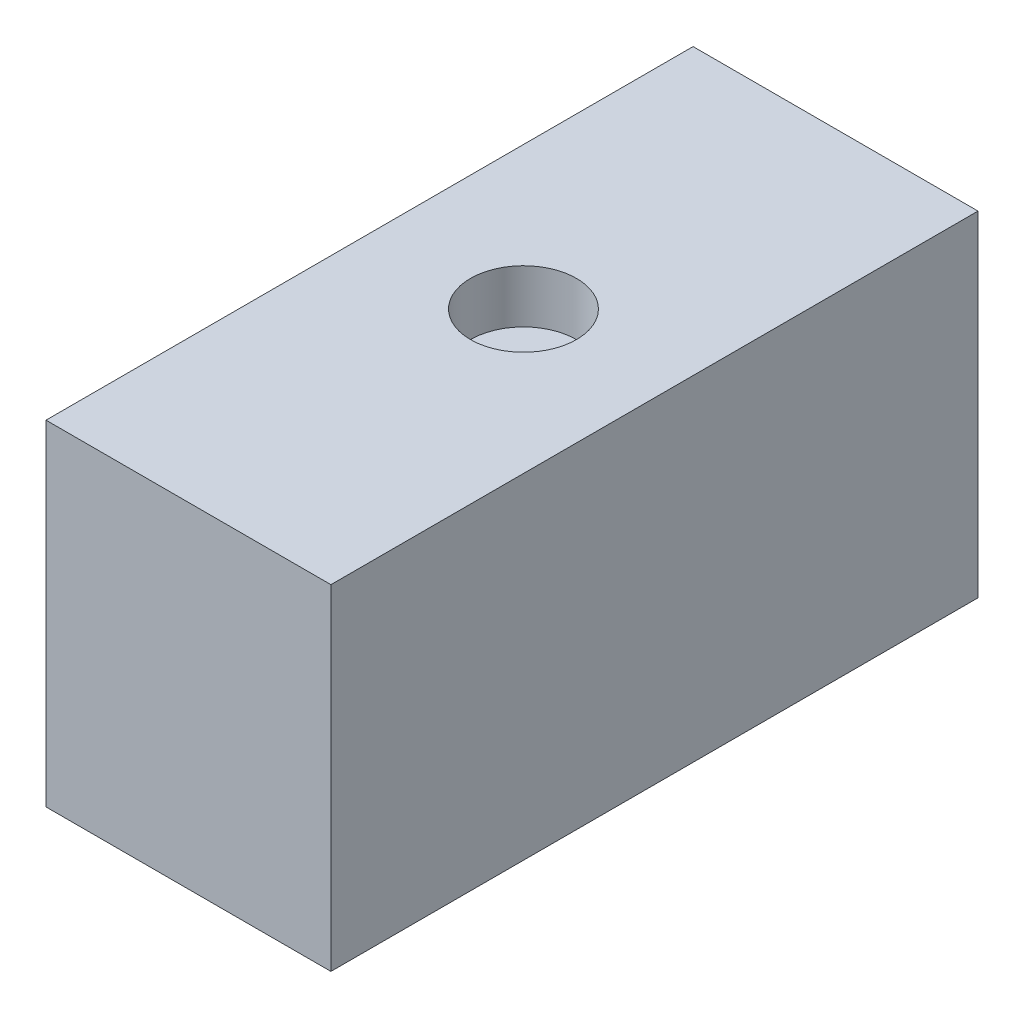
ISO-10303-21;
HEADER;
FILE_DESCRIPTION(('STEP AP214'),'2;1');
FILE_NAME('part.step','',(''),(''),'','','');
FILE_SCHEMA(('AUTOMOTIVE_DESIGN { 1 0 10303 214 1 1 1 1 }'));
ENDSEC;
DATA;
#1=APPLICATION_CONTEXT('core data for automotive mechanical design processes');
#2=APPLICATION_PROTOCOL_DEFINITION('international standard','automotive_design',2000,#1);
#3=PRODUCT_CONTEXT('',#1,'mechanical');
#4=PRODUCT('Part','Part','',(#3));
#5=PRODUCT_RELATED_PRODUCT_CATEGORY('part','',(#4));
#6=PRODUCT_DEFINITION_FORMATION('','',#4);
#7=PRODUCT_DEFINITION_CONTEXT('part definition',#1,'design');
#8=PRODUCT_DEFINITION('design','',#6,#7);
#9=PRODUCT_DEFINITION_SHAPE('','',#8);
#10=(LENGTH_UNIT() NAMED_UNIT(*) SI_UNIT(.MILLI.,.METRE.));
#11=(NAMED_UNIT(*) PLANE_ANGLE_UNIT() SI_UNIT($,.RADIAN.));
#12=(NAMED_UNIT(*) SI_UNIT($,.STERADIAN.) SOLID_ANGLE_UNIT());
#13=UNCERTAINTY_MEASURE_WITH_UNIT(LENGTH_MEASURE(1.E-05),#10,'distance_accuracy_value','');
#14=(GEOMETRIC_REPRESENTATION_CONTEXT(3) GLOBAL_UNCERTAINTY_ASSIGNED_CONTEXT((#13)) GLOBAL_UNIT_ASSIGNED_CONTEXT((#10,
#11,#12)) REPRESENTATION_CONTEXT('',''));
#15=CARTESIAN_POINT('',(0.,0.,0.));
#16=DIRECTION('',(0.,0.,1.));
#17=DIRECTION('',(1.,0.,0.));
#18=AXIS2_PLACEMENT_3D('',#15,#16,#17);
#19=CARTESIAN_POINT('',(0.,160.4772,0.));
#20=DIRECTION('',(1.,0.,0.));
#21=DIRECTION('',(0.,0.,-1.));
#22=AXIS2_PLACEMENT_3D('',#19,#20,#21);
#23=PLANE('',#22);
#24=DIRECTION('',(0.,0.,1.));
#25=VECTOR('',#24,1.);
#26=CARTESIAN_POINT('',(0.,0.,0.));
#27=LINE('',#26,#25);
#28=CARTESIAN_POINT('',(0.,0.,-310.007));
#29=VERTEX_POINT('',#28);
#30=CARTESIAN_POINT('',(0.,0.,0.));
#31=VERTEX_POINT('',#30);
#32=EDGE_CURVE('E95',#29,#31,#27,.T.);
#33=ORIENTED_EDGE('',*,*,#32,.T.);
#34=DIRECTION('',(0.,-1.,0.));
#35=VECTOR('',#34,1.);
#36=CARTESIAN_POINT('',(0.,160.4772,0.));
#37=LINE('',#36,#35);
#38=CARTESIAN_POINT('',(0.,160.4772,0.));
#39=VERTEX_POINT('',#38);
#40=EDGE_CURVE('E11',#39,#31,#37,.T.);
#41=ORIENTED_EDGE('',*,*,#40,.F.);
#42=DIRECTION('',(0.,0.,1.));
#43=VECTOR('',#42,1.);
#44=CARTESIAN_POINT('',(0.,160.4772,0.));
#45=LINE('',#44,#43);
#46=CARTESIAN_POINT('',(0.,160.4772,-310.007));
#47=VERTEX_POINT('',#46);
#48=EDGE_CURVE('E83',#47,#39,#45,.T.);
#49=ORIENTED_EDGE('',*,*,#48,.F.);
#50=DIRECTION('',(0.,-1.,0.));
#51=VECTOR('',#50,1.);
#52=CARTESIAN_POINT('',(0.,160.4772,-310.007));
#53=LINE('',#52,#51);
#54=EDGE_CURVE('E91',#47,#29,#53,.T.);
#55=ORIENTED_EDGE('',*,*,#54,.T.);
#56=EDGE_LOOP('',(#33,#41,#49,#55));
#57=FACE_BOUND('',#56,.T.);
#58=ADVANCED_FACE('F32',(#57),#23,.F.);
#59=CARTESIAN_POINT('',(0.,160.4772,0.));
#60=DIRECTION('',(0.,0.,-1.));
#61=DIRECTION('',(-1.,0.,0.));
#62=AXIS2_PLACEMENT_3D('',#59,#60,#61);
#63=PLANE('',#62);
#64=DIRECTION('',(1.,0.,0.));
#65=VECTOR('',#64,1.);
#66=CARTESIAN_POINT('',(0.,0.,0.));
#67=LINE('',#66,#65);
#68=CARTESIAN_POINT('',(136.4996,0.,0.));
#69=VERTEX_POINT('',#68);
#70=EDGE_CURVE('E87',#31,#69,#67,.T.);
#71=ORIENTED_EDGE('',*,*,#70,.T.);
#72=DIRECTION('',(0.,-1.,0.));
#73=VECTOR('',#72,1.);
#74=CARTESIAN_POINT('',(136.4996,160.4772,0.));
#75=LINE('',#74,#73);
#76=CARTESIAN_POINT('',(136.4996,160.4772,0.));
#77=VERTEX_POINT('',#76);
#78=EDGE_CURVE('E40',#77,#69,#75,.T.);
#79=ORIENTED_EDGE('',*,*,#78,.F.);
#80=DIRECTION('',(1.,0.,0.));
#81=VECTOR('',#80,1.);
#82=CARTESIAN_POINT('',(0.,160.4772,0.));
#83=LINE('',#82,#81);
#84=EDGE_CURVE('E78',#39,#77,#83,.T.);
#85=ORIENTED_EDGE('',*,*,#84,.F.);
#86=ORIENTED_EDGE('',*,*,#40,.T.);
#87=EDGE_LOOP('',(#71,#79,#85,#86));
#88=FACE_BOUND('',#87,.T.);
#89=ADVANCED_FACE('F86',(#88),#63,.F.);
#90=CARTESIAN_POINT('',(136.4996,160.4772,0.));
#91=DIRECTION('',(-1.,0.,0.));
#92=DIRECTION('',(0.,0.,1.));
#93=AXIS2_PLACEMENT_3D('',#90,#91,#92);
#94=PLANE('',#93);
#95=DIRECTION('',(0.,0.,-1.));
#96=VECTOR('',#95,1.);
#97=CARTESIAN_POINT('',(136.4996,0.,0.));
#98=LINE('',#97,#96);
#99=CARTESIAN_POINT('',(136.4996,0.,-310.007));
#100=VERTEX_POINT('',#99);
#101=EDGE_CURVE('E65',#69,#100,#98,.T.);
#102=ORIENTED_EDGE('',*,*,#101,.T.);
#103=DIRECTION('',(0.,-1.,0.));
#104=VECTOR('',#103,1.);
#105=CARTESIAN_POINT('',(136.4996,160.4772,-310.007));
#106=LINE('',#105,#104);
#107=CARTESIAN_POINT('',(136.4996,160.4772,-310.007));
#108=VERTEX_POINT('',#107);
#109=EDGE_CURVE('E88',#108,#100,#106,.T.);
#110=ORIENTED_EDGE('',*,*,#109,.F.);
#111=DIRECTION('',(0.,0.,-1.));
#112=VECTOR('',#111,1.);
#113=CARTESIAN_POINT('',(136.4996,160.4772,0.));
#114=LINE('',#113,#112);
#115=EDGE_CURVE('E81',#77,#108,#114,.T.);
#116=ORIENTED_EDGE('',*,*,#115,.F.);
#117=ORIENTED_EDGE('',*,*,#78,.T.);
#118=EDGE_LOOP('',(#102,#110,#116,#117));
#119=FACE_BOUND('',#118,.T.);
#120=ADVANCED_FACE('F89',(#119),#94,.F.);
#121=CARTESIAN_POINT('',(0.,160.4772,-310.007));
#122=DIRECTION('',(0.,0.,1.));
#123=DIRECTION('',(1.,0.,0.));
#124=AXIS2_PLACEMENT_3D('',#121,#122,#123);
#125=PLANE('',#124);
#126=DIRECTION('',(-1.,0.,0.));
#127=VECTOR('',#126,1.);
#128=CARTESIAN_POINT('',(0.,0.,-310.007));
#129=LINE('',#128,#127);
#130=EDGE_CURVE('E71',#100,#29,#129,.T.);
#131=ORIENTED_EDGE('',*,*,#130,.T.);
#132=ORIENTED_EDGE('',*,*,#54,.F.);
#133=DIRECTION('',(-1.,0.,0.));
#134=VECTOR('',#133,1.);
#135=CARTESIAN_POINT('',(0.,160.4772,-310.007));
#136=LINE('',#135,#134);
#137=EDGE_CURVE('E48',#108,#47,#136,.T.);
#138=ORIENTED_EDGE('',*,*,#137,.F.);
#139=ORIENTED_EDGE('',*,*,#109,.T.);
#140=EDGE_LOOP('',(#131,#132,#138,#139));
#141=FACE_BOUND('',#140,.T.);
#142=ADVANCED_FACE('F103',(#141),#125,.F.);
#143=CARTESIAN_POINT('',(0.,160.4772,-310.007));
#144=DIRECTION('',(0.,-1.,0.));
#145=DIRECTION('',(0.,0.,-1.));
#146=AXIS2_PLACEMENT_3D('',#143,#144,#145);
#147=PLANE('',#146);
#148=CARTESIAN_POINT('',(68.2498,160.4772,-160.5026));
#149=DIRECTION('',(0.,1.,0.));
#150=DIRECTION('',(0.,0.,1.));
#151=AXIS2_PLACEMENT_3D('',#148,#149,#150);
#152=CIRCLE('',#151,25.4);
#153=CARTESIAN_POINT('',(68.2498,160.4772,-135.1026));
#154=VERTEX_POINT('',#153);
#155=EDGE_CURVE('E109',#154,#154,#152,.T.);
#156=ORIENTED_EDGE('',*,*,#155,.F.);
#157=EDGE_LOOP('',(#156));
#158=FACE_BOUND('',#157,.T.);
#159=ORIENTED_EDGE('',*,*,#48,.T.);
#160=ORIENTED_EDGE('',*,*,#84,.T.);
#161=ORIENTED_EDGE('',*,*,#115,.T.);
#162=ORIENTED_EDGE('',*,*,#137,.T.);
#163=EDGE_LOOP('',(#159,#160,#161,#162));
#164=FACE_BOUND('',#163,.T.);
#165=ADVANCED_FACE('F79',(#158,#164),#147,.F.);
#166=CARTESIAN_POINT('',(0.,0.,-310.007));
#167=DIRECTION('',(0.,-1.,0.));
#168=DIRECTION('',(0.,0.,-1.));
#169=AXIS2_PLACEMENT_3D('',#166,#167,#168);
#170=PLANE('',#169);
#171=ORIENTED_EDGE('',*,*,#32,.F.);
#172=ORIENTED_EDGE('',*,*,#130,.F.);
#173=ORIENTED_EDGE('',*,*,#101,.F.);
#174=ORIENTED_EDGE('',*,*,#70,.F.);
#175=EDGE_LOOP('',(#171,#172,#173,#174));
#176=FACE_BOUND('',#175,.T.);
#177=ADVANCED_FACE('F106',(#176),#170,.T.);
#178=CARTESIAN_POINT('',(68.2498,135.0772,-160.5026));
#179=DIRECTION('',(0.,1.,0.));
#180=DIRECTION('',(0.,0.,1.));
#181=AXIS2_PLACEMENT_3D('',#178,#179,#180);
#182=CYLINDRICAL_SURFACE('',#181,25.4);
#183=CARTESIAN_POINT('',(68.2498,135.0772,-160.5026));
#184=DIRECTION('',(0.,1.,0.));
#185=DIRECTION('',(0.,0.,1.));
#186=AXIS2_PLACEMENT_3D('',#183,#184,#185);
#187=CIRCLE('',#186,25.4);
#188=CARTESIAN_POINT('',(68.2498,135.0772,-135.1026));
#189=VERTEX_POINT('',#188);
#190=EDGE_CURVE('E98',#189,#189,#187,.T.);
#191=ORIENTED_EDGE('',*,*,#190,.F.);
#192=EDGE_LOOP('',(#191));
#193=FACE_BOUND('',#192,.T.);
#194=ORIENTED_EDGE('',*,*,#155,.T.);
#195=EDGE_LOOP('',(#194));
#196=FACE_BOUND('',#195,.T.);
#197=ADVANCED_FACE('F117',(#193,#196),#182,.F.);
#198=CARTESIAN_POINT('',(68.2498,135.0772,-160.5026));
#199=DIRECTION('',(0.,1.,0.));
#200=DIRECTION('',(0.,0.,1.));
#201=AXIS2_PLACEMENT_3D('',#198,#199,#200);
#202=PLANE('',#201);
#203=ORIENTED_EDGE('',*,*,#190,.T.);
#204=EDGE_LOOP('',(#203));
#205=FACE_BOUND('',#204,.T.);
#206=ADVANCED_FACE('F115',(#205),#202,.T.);
#207=CLOSED_SHELL('',(#58,#89,#120,#142,#165,#177,#197,#206));
#208=MANIFOLD_SOLID_BREP('B2',#207);
#209=ADVANCED_BREP_SHAPE_REPRESENTATION('',(#18,#208),#14);
#210=SHAPE_DEFINITION_REPRESENTATION(#9,#209);
ENDSEC;
END-ISO-10303-21;
